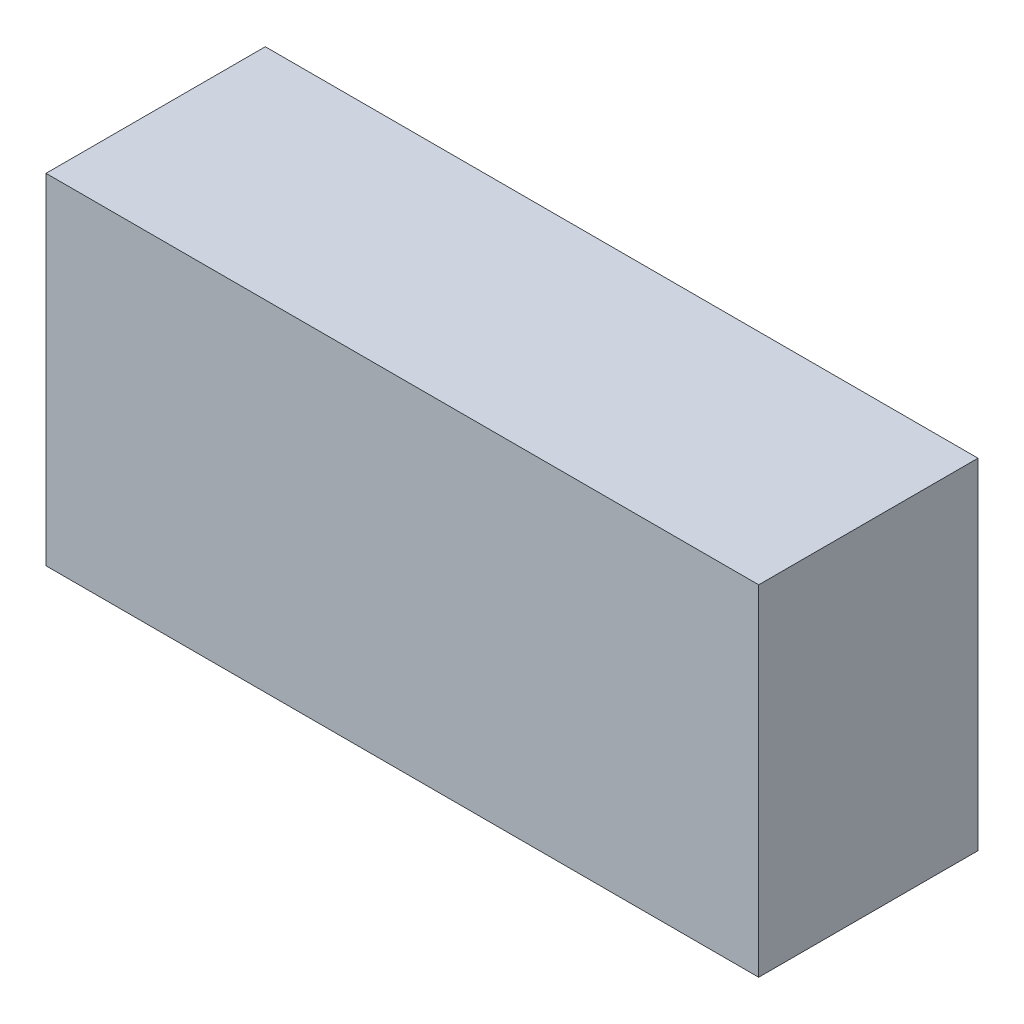
ISO-10303-21;
HEADER;
FILE_DESCRIPTION(('STEP AP214'),'2;1');
FILE_NAME('part.step','',(''),(''),'','','');
FILE_SCHEMA(('AUTOMOTIVE_DESIGN { 1 0 10303 214 1 1 1 1 }'));
ENDSEC;
DATA;
#1=APPLICATION_CONTEXT('core data for automotive mechanical design processes');
#2=APPLICATION_PROTOCOL_DEFINITION('international standard','automotive_design',2000,#1);
#3=PRODUCT_CONTEXT('',#1,'mechanical');
#4=PRODUCT('Part','Part','',(#3));
#5=PRODUCT_RELATED_PRODUCT_CATEGORY('part','',(#4));
#6=PRODUCT_DEFINITION_FORMATION('','',#4);
#7=PRODUCT_DEFINITION_CONTEXT('part definition',#1,'design');
#8=PRODUCT_DEFINITION('design','',#6,#7);
#9=PRODUCT_DEFINITION_SHAPE('','',#8);
#10=(LENGTH_UNIT() NAMED_UNIT(*) SI_UNIT(.MILLI.,.METRE.));
#11=(NAMED_UNIT(*) PLANE_ANGLE_UNIT() SI_UNIT($,.RADIAN.));
#12=(NAMED_UNIT(*) SI_UNIT($,.STERADIAN.) SOLID_ANGLE_UNIT());
#13=UNCERTAINTY_MEASURE_WITH_UNIT(LENGTH_MEASURE(1.E-05),#10,'distance_accuracy_value','');
#14=(GEOMETRIC_REPRESENTATION_CONTEXT(3) GLOBAL_UNCERTAINTY_ASSIGNED_CONTEXT((#13)) GLOBAL_UNIT_ASSIGNED_CONTEXT((#10,
#11,#12)) REPRESENTATION_CONTEXT('',''));
#15=CARTESIAN_POINT('',(0.,0.,0.));
#16=DIRECTION('',(0.,0.,1.));
#17=DIRECTION('',(1.,0.,0.));
#18=AXIS2_PLACEMENT_3D('',#15,#16,#17);
#19=CARTESIAN_POINT('',(9.75,9.3,-3.));
#20=DIRECTION('',(-1.,0.,0.));
#21=DIRECTION('',(0.,0.,1.));
#22=AXIS2_PLACEMENT_3D('',#19,#20,#21);
#23=PLANE('',#22);
#24=DIRECTION('',(0.,0.,-1.));
#25=VECTOR('',#24,1.);
#26=CARTESIAN_POINT('',(9.75,0.,-3.));
#27=LINE('',#26,#25);
#28=CARTESIAN_POINT('',(9.75,0.,3.));
#29=VERTEX_POINT('',#28);
#30=CARTESIAN_POINT('',(9.75,0.,-3.));
#31=VERTEX_POINT('',#30);
#32=EDGE_CURVE('E403',#29,#31,#27,.T.);
#33=ORIENTED_EDGE('',*,*,#32,.T.);
#34=DIRECTION('',(0.,-1.,0.));
#35=VECTOR('',#34,1.);
#36=CARTESIAN_POINT('',(9.75,9.3,-3.));
#37=LINE('',#36,#35);
#38=CARTESIAN_POINT('',(9.75,9.3,-3.));
#39=VERTEX_POINT('',#38);
#40=EDGE_CURVE('E11',#39,#31,#37,.T.);
#41=ORIENTED_EDGE('',*,*,#40,.F.);
#42=DIRECTION('',(0.,0.,-1.));
#43=VECTOR('',#42,1.);
#44=CARTESIAN_POINT('',(9.75,9.3,-3.));
#45=LINE('',#44,#43);
#46=CARTESIAN_POINT('',(9.75,9.3,3.));
#47=VERTEX_POINT('',#46);
#48=EDGE_CURVE('E414',#47,#39,#45,.T.);
#49=ORIENTED_EDGE('',*,*,#48,.F.);
#50=DIRECTION('',(0.,-1.,0.));
#51=VECTOR('',#50,1.);
#52=CARTESIAN_POINT('',(9.75,9.3,3.));
#53=LINE('',#52,#51);
#54=EDGE_CURVE('E428',#47,#29,#53,.T.);
#55=ORIENTED_EDGE('',*,*,#54,.T.);
#56=EDGE_LOOP('',(#33,#41,#49,#55));
#57=FACE_BOUND('',#56,.T.);
#58=ADVANCED_FACE('F39',(#57),#23,.F.);
#59=CARTESIAN_POINT('',(-9.75,9.3,-3.));
#60=DIRECTION('',(0.,0.,1.));
#61=DIRECTION('',(1.,0.,0.));
#62=AXIS2_PLACEMENT_3D('',#59,#60,#61);
#63=PLANE('',#62);
#64=DIRECTION('',(-1.,0.,0.));
#65=VECTOR('',#64,1.);
#66=CARTESIAN_POINT('',(-9.75,0.,-3.));
#67=LINE('',#66,#65);
#68=CARTESIAN_POINT('',(-9.75,0.,-3.));
#69=VERTEX_POINT('',#68);
#70=EDGE_CURVE('E432',#31,#69,#67,.T.);
#71=ORIENTED_EDGE('',*,*,#70,.T.);
#72=DIRECTION('',(0.,-1.,0.));
#73=VECTOR('',#72,1.);
#74=CARTESIAN_POINT('',(-9.75,9.3,-3.));
#75=LINE('',#74,#73);
#76=CARTESIAN_POINT('',(-9.75,9.3,-3.));
#77=VERTEX_POINT('',#76);
#78=EDGE_CURVE('E47',#77,#69,#75,.T.);
#79=ORIENTED_EDGE('',*,*,#78,.F.);
#80=DIRECTION('',(-1.,0.,0.));
#81=VECTOR('',#80,1.);
#82=CARTESIAN_POINT('',(-9.75,9.3,-3.));
#83=LINE('',#82,#81);
#84=EDGE_CURVE('E418',#39,#77,#83,.T.);
#85=ORIENTED_EDGE('',*,*,#84,.F.);
#86=ORIENTED_EDGE('',*,*,#40,.T.);
#87=EDGE_LOOP('',(#71,#79,#85,#86));
#88=FACE_BOUND('',#87,.T.);
#89=ADVANCED_FACE('F467',(#88),#63,.F.);
#90=CARTESIAN_POINT('',(-9.75,9.3,-3.));
#91=DIRECTION('',(1.,0.,0.));
#92=DIRECTION('',(0.,0.,-1.));
#93=AXIS2_PLACEMENT_3D('',#90,#91,#92);
#94=PLANE('',#93);
#95=DIRECTION('',(0.,0.,1.));
#96=VECTOR('',#95,1.);
#97=CARTESIAN_POINT('',(-9.75,0.,-3.));
#98=LINE('',#97,#96);
#99=CARTESIAN_POINT('',(-9.75,0.,3.));
#100=VERTEX_POINT('',#99);
#101=EDGE_CURVE('E435',#69,#100,#98,.T.);
#102=ORIENTED_EDGE('',*,*,#101,.T.);
#103=DIRECTION('',(0.,-1.,0.));
#104=VECTOR('',#103,1.);
#105=CARTESIAN_POINT('',(-9.75,9.3,3.));
#106=LINE('',#105,#104);
#107=CARTESIAN_POINT('',(-9.75,9.3,3.));
#108=VERTEX_POINT('',#107);
#109=EDGE_CURVE('E443',#108,#100,#106,.T.);
#110=ORIENTED_EDGE('',*,*,#109,.F.);
#111=DIRECTION('',(0.,0.,1.));
#112=VECTOR('',#111,1.);
#113=CARTESIAN_POINT('',(-9.75,9.3,-3.));
#114=LINE('',#113,#112);
#115=EDGE_CURVE('E422',#77,#108,#114,.T.);
#116=ORIENTED_EDGE('',*,*,#115,.F.);
#117=ORIENTED_EDGE('',*,*,#78,.T.);
#118=EDGE_LOOP('',(#102,#110,#116,#117));
#119=FACE_BOUND('',#118,.T.);
#120=ADVANCED_FACE('F452',(#119),#94,.F.);
#121=CARTESIAN_POINT('',(-9.75,9.3,3.));
#122=DIRECTION('',(0.,0.,-1.));
#123=DIRECTION('',(-1.,0.,0.));
#124=AXIS2_PLACEMENT_3D('',#121,#122,#123);
#125=PLANE('',#124);
#126=DIRECTION('',(1.,0.,0.));
#127=VECTOR('',#126,1.);
#128=CARTESIAN_POINT('',(-9.75,0.,3.));
#129=LINE('',#128,#127);
#130=EDGE_CURVE('E419',#100,#29,#129,.T.);
#131=ORIENTED_EDGE('',*,*,#130,.T.);
#132=ORIENTED_EDGE('',*,*,#54,.F.);
#133=DIRECTION('',(1.,0.,0.));
#134=VECTOR('',#133,1.);
#135=CARTESIAN_POINT('',(-9.75,9.3,3.));
#136=LINE('',#135,#134);
#137=EDGE_CURVE('E425',#108,#47,#136,.T.);
#138=ORIENTED_EDGE('',*,*,#137,.F.);
#139=ORIENTED_EDGE('',*,*,#109,.T.);
#140=EDGE_LOOP('',(#131,#132,#138,#139));
#141=FACE_BOUND('',#140,.T.);
#142=ADVANCED_FACE('F460',(#141),#125,.F.);
#143=CARTESIAN_POINT('',(0.,9.3,0.));
#144=DIRECTION('',(0.,1.,0.));
#145=DIRECTION('',(0.,0.,1.));
#146=AXIS2_PLACEMENT_3D('',#143,#144,#145);
#147=PLANE('',#146);
#148=ORIENTED_EDGE('',*,*,#48,.T.);
#149=ORIENTED_EDGE('',*,*,#84,.T.);
#150=ORIENTED_EDGE('',*,*,#115,.T.);
#151=ORIENTED_EDGE('',*,*,#137,.T.);
#152=EDGE_LOOP('',(#148,#149,#150,#151));
#153=FACE_BOUND('',#152,.T.);
#154=ADVANCED_FACE('F466',(#153),#147,.T.);
#155=CARTESIAN_POINT('',(0.,0.,0.));
#156=DIRECTION('',(0.,1.,0.));
#157=DIRECTION('',(0.,0.,1.));
#158=AXIS2_PLACEMENT_3D('',#155,#156,#157);
#159=PLANE('',#158);
#160=DIRECTION('',(0.,0.,-1.));
#161=VECTOR('',#160,1.);
#162=CARTESIAN_POINT('',(4.78,0.,-1.2));
#163=LINE('',#162,#161);
#164=CARTESIAN_POINT('',(4.78,0.,-1.2));
#165=VERTEX_POINT('',#164);
#166=CARTESIAN_POINT('',(4.78,0.,-1.5));
#167=VERTEX_POINT('',#166);
#168=EDGE_CURVE('E208',#165,#167,#163,.T.);
#169=ORIENTED_EDGE('',*,*,#168,.F.);
#170=DIRECTION('',(1.,0.,0.));
#171=VECTOR('',#170,1.);
#172=CARTESIAN_POINT('',(4.78,0.,-1.2));
#173=LINE('',#172,#171);
#174=CARTESIAN_POINT('',(5.38,0.,-1.2));
#175=VERTEX_POINT('',#174);
#176=EDGE_CURVE('E217',#165,#175,#173,.T.);
#177=ORIENTED_EDGE('',*,*,#176,.T.);
#178=DIRECTION('',(0.,0.,-1.));
#179=VECTOR('',#178,1.);
#180=CARTESIAN_POINT('',(5.38,0.,-1.2));
#181=LINE('',#180,#179);
#182=CARTESIAN_POINT('',(5.38,0.,-1.5));
#183=VERTEX_POINT('',#182);
#184=EDGE_CURVE('E225',#175,#183,#181,.T.);
#185=ORIENTED_EDGE('',*,*,#184,.T.);
#186=DIRECTION('',(1.,0.,0.));
#187=VECTOR('',#186,1.);
#188=CARTESIAN_POINT('',(4.78,0.,-1.5));
#189=LINE('',#188,#187);
#190=EDGE_CURVE('E54',#167,#183,#189,.T.);
#191=ORIENTED_EDGE('',*,*,#190,.F.);
#192=EDGE_LOOP('',(#169,#177,#185,#191));
#193=FACE_BOUND('',#192,.T.);
#194=DIRECTION('',(0.,0.,-1.));
#195=VECTOR('',#194,1.);
#196=CARTESIAN_POINT('',(2.24,0.,-1.2));
#197=LINE('',#196,#195);
#198=CARTESIAN_POINT('',(2.24,0.,-1.2));
#199=VERTEX_POINT('',#198);
#200=CARTESIAN_POINT('',(2.24,0.,-1.5));
#201=VERTEX_POINT('',#200);
#202=EDGE_CURVE('E261',#199,#201,#197,.T.);
#203=ORIENTED_EDGE('',*,*,#202,.F.);
#204=DIRECTION('',(1.,0.,0.));
#205=VECTOR('',#204,1.);
#206=CARTESIAN_POINT('',(2.24,0.,-1.2));
#207=LINE('',#206,#205);
#208=CARTESIAN_POINT('',(2.84,0.,-1.2));
#209=VERTEX_POINT('',#208);
#210=EDGE_CURVE('E271',#199,#209,#207,.T.);
#211=ORIENTED_EDGE('',*,*,#210,.T.);
#212=DIRECTION('',(0.,0.,-1.));
#213=VECTOR('',#212,1.);
#214=CARTESIAN_POINT('',(2.84,0.,-1.2));
#215=LINE('',#214,#213);
#216=CARTESIAN_POINT('',(2.84,0.,-1.5));
#217=VERTEX_POINT('',#216);
#218=EDGE_CURVE('E267',#209,#217,#215,.T.);
#219=ORIENTED_EDGE('',*,*,#218,.T.);
#220=DIRECTION('',(1.,0.,0.));
#221=VECTOR('',#220,1.);
#222=CARTESIAN_POINT('',(2.24,0.,-1.5));
#223=LINE('',#222,#221);
#224=EDGE_CURVE('E62',#201,#217,#223,.T.);
#225=ORIENTED_EDGE('',*,*,#224,.F.);
#226=EDGE_LOOP('',(#203,#211,#219,#225));
#227=FACE_BOUND('',#226,.T.);
#228=DIRECTION('',(0.,0.,-1.));
#229=VECTOR('',#228,1.);
#230=CARTESIAN_POINT('',(-0.299999999999996,0.,-1.2));
#231=LINE('',#230,#229);
#232=CARTESIAN_POINT('',(-0.299999999999996,0.,-1.2));
#233=VERTEX_POINT('',#232);
#234=CARTESIAN_POINT('',(-0.299999999999996,0.,-1.5));
#235=VERTEX_POINT('',#234);
#236=EDGE_CURVE('E302',#233,#235,#231,.T.);
#237=ORIENTED_EDGE('',*,*,#236,.F.);
#238=DIRECTION('',(1.,0.,0.));
#239=VECTOR('',#238,1.);
#240=CARTESIAN_POINT('',(-0.299999999999996,0.,-1.2));
#241=LINE('',#240,#239);
#242=CARTESIAN_POINT('',(0.300000000000004,0.,-1.2));
#243=VERTEX_POINT('',#242);
#244=EDGE_CURVE('E313',#233,#243,#241,.T.);
#245=ORIENTED_EDGE('',*,*,#244,.T.);
#246=DIRECTION('',(0.,0.,-1.));
#247=VECTOR('',#246,1.);
#248=CARTESIAN_POINT('',(0.300000000000004,0.,-1.2));
#249=LINE('',#248,#247);
#250=CARTESIAN_POINT('',(0.300000000000004,0.,-1.5));
#251=VERTEX_POINT('',#250);
#252=EDGE_CURVE('E309',#243,#251,#249,.T.);
#253=ORIENTED_EDGE('',*,*,#252,.T.);
#254=DIRECTION('',(1.,0.,0.));
#255=VECTOR('',#254,1.);
#256=CARTESIAN_POINT('',(-0.299999999999996,0.,-1.5));
#257=LINE('',#256,#255);
#258=EDGE_CURVE('E305',#235,#251,#257,.T.);
#259=ORIENTED_EDGE('',*,*,#258,.F.);
#260=EDGE_LOOP('',(#237,#245,#253,#259));
#261=FACE_BOUND('',#260,.T.);
#262=DIRECTION('',(0.,0.,-1.));
#263=VECTOR('',#262,1.);
#264=CARTESIAN_POINT('',(-5.38,0.,-1.2));
#265=LINE('',#264,#263);
#266=CARTESIAN_POINT('',(-5.38,0.,-1.2));
#267=VERTEX_POINT('',#266);
#268=CARTESIAN_POINT('',(-5.38,0.,-1.5));
#269=VERTEX_POINT('',#268);
#270=EDGE_CURVE('E344',#267,#269,#265,.T.);
#271=ORIENTED_EDGE('',*,*,#270,.F.);
#272=DIRECTION('',(1.,0.,0.));
#273=VECTOR('',#272,1.);
#274=CARTESIAN_POINT('',(-5.38,0.,-1.2));
#275=LINE('',#274,#273);
#276=CARTESIAN_POINT('',(-4.78,0.,-1.2));
#277=VERTEX_POINT('',#276);
#278=EDGE_CURVE('E355',#267,#277,#275,.T.);
#279=ORIENTED_EDGE('',*,*,#278,.T.);
#280=DIRECTION('',(0.,0.,-1.));
#281=VECTOR('',#280,1.);
#282=CARTESIAN_POINT('',(-4.78,0.,-1.2));
#283=LINE('',#282,#281);
#284=CARTESIAN_POINT('',(-4.78,0.,-1.5));
#285=VERTEX_POINT('',#284);
#286=EDGE_CURVE('E351',#277,#285,#283,.T.);
#287=ORIENTED_EDGE('',*,*,#286,.T.);
#288=DIRECTION('',(1.,0.,0.));
#289=VECTOR('',#288,1.);
#290=CARTESIAN_POINT('',(-5.38,0.,-1.5));
#291=LINE('',#290,#289);
#292=EDGE_CURVE('E347',#269,#285,#291,.T.);
#293=ORIENTED_EDGE('',*,*,#292,.F.);
#294=EDGE_LOOP('',(#271,#279,#287,#293));
#295=FACE_BOUND('',#294,.T.);
#296=DIRECTION('',(0.,0.,-1.));
#297=VECTOR('',#296,1.);
#298=CARTESIAN_POINT('',(-7.92,0.,-1.2));
#299=LINE('',#298,#297);
#300=CARTESIAN_POINT('',(-7.92,0.,-1.2));
#301=VERTEX_POINT('',#300);
#302=CARTESIAN_POINT('',(-7.92,0.,-1.5));
#303=VERTEX_POINT('',#302);
#304=EDGE_CURVE('E377',#301,#303,#299,.T.);
#305=ORIENTED_EDGE('',*,*,#304,.F.);
#306=DIRECTION('',(1.,0.,0.));
#307=VECTOR('',#306,1.);
#308=CARTESIAN_POINT('',(-7.92,0.,-1.2));
#309=LINE('',#308,#307);
#310=CARTESIAN_POINT('',(-7.32,0.,-1.2));
#311=VERTEX_POINT('',#310);
#312=EDGE_CURVE('E359',#301,#311,#309,.T.);
#313=ORIENTED_EDGE('',*,*,#312,.T.);
#314=DIRECTION('',(0.,0.,-1.));
#315=VECTOR('',#314,1.);
#316=CARTESIAN_POINT('',(-7.32,0.,-1.2));
#317=LINE('',#316,#315);
#318=CARTESIAN_POINT('',(-7.31999999999999,0.,-1.5));
#319=VERTEX_POINT('',#318);
#320=EDGE_CURVE('E391',#311,#319,#317,.T.);
#321=ORIENTED_EDGE('',*,*,#320,.T.);
#322=DIRECTION('',(1.,0.,0.));
#323=VECTOR('',#322,1.);
#324=CARTESIAN_POINT('',(-7.92,0.,-1.5));
#325=LINE('',#324,#323);
#326=EDGE_CURVE('E395',#303,#319,#325,.T.);
#327=ORIENTED_EDGE('',*,*,#326,.F.);
#328=EDGE_LOOP('',(#305,#313,#321,#327));
#329=FACE_BOUND('',#328,.T.);
#330=ORIENTED_EDGE('',*,*,#32,.F.);
#331=ORIENTED_EDGE('',*,*,#130,.F.);
#332=ORIENTED_EDGE('',*,*,#101,.F.);
#333=ORIENTED_EDGE('',*,*,#70,.F.);
#334=EDGE_LOOP('',(#330,#331,#332,#333));
#335=FACE_BOUND('',#334,.T.);
#336=ADVANCED_FACE('F227',(#193,#227,#261,#295,#329,#335),#159,.F.);
#337=CARTESIAN_POINT('',(-7.92,-3.,-1.2));
#338=DIRECTION('',(0.,0.,1.));
#339=DIRECTION('',(1.,0.,0.));
#340=AXIS2_PLACEMENT_3D('',#337,#338,#339);
#341=PLANE('',#340);
#342=ORIENTED_EDGE('',*,*,#312,.F.);
#343=DIRECTION('',(0.,1.,0.));
#344=VECTOR('',#343,1.);
#345=CARTESIAN_POINT('',(-7.92,-3.,-1.2));
#346=LINE('',#345,#344);
#347=CARTESIAN_POINT('',(-7.92,-3.,-1.2));
#348=VERTEX_POINT('',#347);
#349=EDGE_CURVE('E400',#348,#301,#346,.T.);
#350=ORIENTED_EDGE('',*,*,#349,.F.);
#351=DIRECTION('',(1.,0.,0.));
#352=VECTOR('',#351,1.);
#353=CARTESIAN_POINT('',(-7.92,-3.,-1.2));
#354=LINE('',#353,#352);
#355=CARTESIAN_POINT('',(-7.32,-3.,-1.2));
#356=VERTEX_POINT('',#355);
#357=EDGE_CURVE('E372',#348,#356,#354,.T.);
#358=ORIENTED_EDGE('',*,*,#357,.T.);
#359=DIRECTION('',(0.,1.,0.));
#360=VECTOR('',#359,1.);
#361=CARTESIAN_POINT('',(-7.32,-3.,-1.2));
#362=LINE('',#361,#360);
#363=EDGE_CURVE('E387',#356,#311,#362,.T.);
#364=ORIENTED_EDGE('',*,*,#363,.T.);
#365=EDGE_LOOP('',(#342,#350,#358,#364));
#366=FACE_BOUND('',#365,.T.);
#367=ADVANCED_FACE('F479',(#366),#341,.T.);
#368=CARTESIAN_POINT('',(-7.92,-3.,-1.2));
#369=DIRECTION('',(1.,0.,0.));
#370=DIRECTION('',(0.,0.,-1.));
#371=AXIS2_PLACEMENT_3D('',#368,#369,#370);
#372=PLANE('',#371);
#373=ORIENTED_EDGE('',*,*,#304,.T.);
#374=DIRECTION('',(0.,1.,0.));
#375=VECTOR('',#374,1.);
#376=CARTESIAN_POINT('',(-7.92,-3.,-1.5));
#377=LINE('',#376,#375);
#378=CARTESIAN_POINT('',(-7.92,-3.,-1.5));
#379=VERTEX_POINT('',#378);
#380=EDGE_CURVE('E404',#379,#303,#377,.T.);
#381=ORIENTED_EDGE('',*,*,#380,.F.);
#382=DIRECTION('',(0.,0.,-1.));
#383=VECTOR('',#382,1.);
#384=CARTESIAN_POINT('',(-7.92,-3.,-1.2));
#385=LINE('',#384,#383);
#386=EDGE_CURVE('E384',#348,#379,#385,.T.);
#387=ORIENTED_EDGE('',*,*,#386,.F.);
#388=ORIENTED_EDGE('',*,*,#349,.T.);
#389=EDGE_LOOP('',(#373,#381,#387,#388));
#390=FACE_BOUND('',#389,.T.);
#391=ADVANCED_FACE('F484',(#390),#372,.F.);
#392=CARTESIAN_POINT('',(-7.92,-3.,-1.5));
#393=DIRECTION('',(0.,0.,1.));
#394=DIRECTION('',(1.,0.,0.));
#395=AXIS2_PLACEMENT_3D('',#392,#393,#394);
#396=PLANE('',#395);
#397=ORIENTED_EDGE('',*,*,#326,.T.);
#398=DIRECTION('',(0.,1.,0.));
#399=VECTOR('',#398,1.);
#400=CARTESIAN_POINT('',(-7.31999999999999,-3.,-1.5));
#401=LINE('',#400,#399);
#402=CARTESIAN_POINT('',(-7.31999999999999,-3.,-1.5));
#403=VERTEX_POINT('',#402);
#404=EDGE_CURVE('E408',#403,#319,#401,.T.);
#405=ORIENTED_EDGE('',*,*,#404,.F.);
#406=DIRECTION('',(1.,0.,0.));
#407=VECTOR('',#406,1.);
#408=CARTESIAN_POINT('',(-7.92,-3.,-1.5));
#409=LINE('',#408,#407);
#410=EDGE_CURVE('E381',#379,#403,#409,.T.);
#411=ORIENTED_EDGE('',*,*,#410,.F.);
#412=ORIENTED_EDGE('',*,*,#380,.T.);
#413=EDGE_LOOP('',(#397,#405,#411,#412));
#414=FACE_BOUND('',#413,.T.);
#415=ADVANCED_FACE('F490',(#414),#396,.F.);
#416=CARTESIAN_POINT('',(-7.32,-3.,-1.2));
#417=DIRECTION('',(1.,0.,0.));
#418=DIRECTION('',(0.,0.,-1.));
#419=AXIS2_PLACEMENT_3D('',#416,#417,#418);
#420=PLANE('',#419);
#421=ORIENTED_EDGE('',*,*,#320,.F.);
#422=ORIENTED_EDGE('',*,*,#363,.F.);
#423=DIRECTION('',(0.,0.,-1.));
#424=VECTOR('',#423,1.);
#425=CARTESIAN_POINT('',(-7.32,-3.,-1.2));
#426=LINE('',#425,#424);
#427=EDGE_CURVE('E376',#356,#403,#426,.T.);
#428=ORIENTED_EDGE('',*,*,#427,.T.);
#429=ORIENTED_EDGE('',*,*,#404,.T.);
#430=EDGE_LOOP('',(#421,#422,#428,#429));
#431=FACE_BOUND('',#430,.T.);
#432=ADVANCED_FACE('F486',(#431),#420,.T.);
#433=CARTESIAN_POINT('',(0.,-3.,0.));
#434=DIRECTION('',(0.,1.,0.));
#435=DIRECTION('',(0.,0.,1.));
#436=AXIS2_PLACEMENT_3D('',#433,#434,#435);
#437=PLANE('',#436);
#438=ORIENTED_EDGE('',*,*,#357,.F.);
#439=ORIENTED_EDGE('',*,*,#386,.T.);
#440=ORIENTED_EDGE('',*,*,#410,.T.);
#441=ORIENTED_EDGE('',*,*,#427,.F.);
#442=EDGE_LOOP('',(#438,#439,#440,#441));
#443=FACE_BOUND('',#442,.T.);
#444=ADVANCED_FACE('F489',(#443),#437,.F.);
#445=CARTESIAN_POINT('',(-5.38,-3.,-1.2));
#446=DIRECTION('',(0.,0.,1.));
#447=DIRECTION('',(1.,0.,0.));
#448=AXIS2_PLACEMENT_3D('',#445,#446,#447);
#449=PLANE('',#448);
#450=ORIENTED_EDGE('',*,*,#278,.F.);
#451=DIRECTION('',(0.,1.,0.));
#452=VECTOR('',#451,1.);
#453=CARTESIAN_POINT('',(-5.38,-3.,-1.2));
#454=LINE('',#453,#452);
#455=CARTESIAN_POINT('',(-5.38,-3.,-1.2));
#456=VERTEX_POINT('',#455);
#457=EDGE_CURVE('E317',#456,#267,#454,.T.);
#458=ORIENTED_EDGE('',*,*,#457,.F.);
#459=DIRECTION('',(1.,0.,0.));
#460=VECTOR('',#459,1.);
#461=CARTESIAN_POINT('',(-5.38,-3.,-1.2));
#462=LINE('',#461,#460);
#463=CARTESIAN_POINT('',(-4.78,-3.,-1.2));
#464=VERTEX_POINT('',#463);
#465=EDGE_CURVE('E348',#456,#464,#462,.T.);
#466=ORIENTED_EDGE('',*,*,#465,.T.);
#467=DIRECTION('',(0.,1.,0.));
#468=VECTOR('',#467,1.);
#469=CARTESIAN_POINT('',(-4.78,-3.,-1.2));
#470=LINE('',#469,#468);
#471=EDGE_CURVE('E330',#464,#277,#470,.T.);
#472=ORIENTED_EDGE('',*,*,#471,.T.);
#473=EDGE_LOOP('',(#450,#458,#466,#472));
#474=FACE_BOUND('',#473,.T.);
#475=ADVANCED_FACE('F500',(#474),#449,.T.);
#476=CARTESIAN_POINT('',(-5.38,-3.,-1.2));
#477=DIRECTION('',(1.,0.,0.));
#478=DIRECTION('',(0.,0.,-1.));
#479=AXIS2_PLACEMENT_3D('',#476,#477,#478);
#480=PLANE('',#479);
#481=ORIENTED_EDGE('',*,*,#270,.T.);
#482=DIRECTION('',(0.,1.,0.));
#483=VECTOR('',#482,1.);
#484=CARTESIAN_POINT('',(-5.38,-3.,-1.5));
#485=LINE('',#484,#483);
#486=CARTESIAN_POINT('',(-5.38,-3.,-1.5));
#487=VERTEX_POINT('',#486);
#488=EDGE_CURVE('E338',#487,#269,#485,.T.);
#489=ORIENTED_EDGE('',*,*,#488,.F.);
#490=DIRECTION('',(0.,0.,-1.));
#491=VECTOR('',#490,1.);
#492=CARTESIAN_POINT('',(-5.38,-3.,-1.2));
#493=LINE('',#492,#491);
#494=EDGE_CURVE('E333',#456,#487,#493,.T.);
#495=ORIENTED_EDGE('',*,*,#494,.F.);
#496=ORIENTED_EDGE('',*,*,#457,.T.);
#497=EDGE_LOOP('',(#481,#489,#495,#496));
#498=FACE_BOUND('',#497,.T.);
#499=ADVANCED_FACE('F508',(#498),#480,.F.);
#500=CARTESIAN_POINT('',(-5.38,-3.,-1.5));
#501=DIRECTION('',(0.,0.,1.));
#502=DIRECTION('',(1.,0.,0.));
#503=AXIS2_PLACEMENT_3D('',#500,#501,#502);
#504=PLANE('',#503);
#505=ORIENTED_EDGE('',*,*,#292,.T.);
#506=DIRECTION('',(0.,1.,0.));
#507=VECTOR('',#506,1.);
#508=CARTESIAN_POINT('',(-4.78,-3.,-1.5));
#509=LINE('',#508,#507);
#510=CARTESIAN_POINT('',(-4.78,-3.,-1.5));
#511=VERTEX_POINT('',#510);
#512=EDGE_CURVE('E334',#511,#285,#509,.T.);
#513=ORIENTED_EDGE('',*,*,#512,.F.);
#514=DIRECTION('',(1.,0.,0.));
#515=VECTOR('',#514,1.);
#516=CARTESIAN_POINT('',(-5.38,-3.,-1.5));
#517=LINE('',#516,#515);
#518=EDGE_CURVE('E362',#487,#511,#517,.T.);
#519=ORIENTED_EDGE('',*,*,#518,.F.);
#520=ORIENTED_EDGE('',*,*,#488,.T.);
#521=EDGE_LOOP('',(#505,#513,#519,#520));
#522=FACE_BOUND('',#521,.T.);
#523=ADVANCED_FACE('F511',(#522),#504,.F.);
#524=CARTESIAN_POINT('',(-4.78,-3.,-1.2));
#525=DIRECTION('',(1.,0.,0.));
#526=DIRECTION('',(0.,0.,-1.));
#527=AXIS2_PLACEMENT_3D('',#524,#525,#526);
#528=PLANE('',#527);
#529=ORIENTED_EDGE('',*,*,#286,.F.);
#530=ORIENTED_EDGE('',*,*,#471,.F.);
#531=DIRECTION('',(0.,0.,-1.));
#532=VECTOR('',#531,1.);
#533=CARTESIAN_POINT('',(-4.78,-3.,-1.2));
#534=LINE('',#533,#532);
#535=EDGE_CURVE('E365',#464,#511,#534,.T.);
#536=ORIENTED_EDGE('',*,*,#535,.T.);
#537=ORIENTED_EDGE('',*,*,#512,.T.);
#538=EDGE_LOOP('',(#529,#530,#536,#537));
#539=FACE_BOUND('',#538,.T.);
#540=ADVANCED_FACE('F506',(#539),#528,.T.);
#541=CARTESIAN_POINT('',(0.,-3.,0.));
#542=DIRECTION('',(0.,1.,0.));
#543=DIRECTION('',(0.,0.,1.));
#544=AXIS2_PLACEMENT_3D('',#541,#542,#543);
#545=PLANE('',#544);
#546=ORIENTED_EDGE('',*,*,#465,.F.);
#547=ORIENTED_EDGE('',*,*,#494,.T.);
#548=ORIENTED_EDGE('',*,*,#518,.T.);
#549=ORIENTED_EDGE('',*,*,#535,.F.);
#550=EDGE_LOOP('',(#546,#547,#548,#549));
#551=FACE_BOUND('',#550,.T.);
#552=ADVANCED_FACE('F502',(#551),#545,.F.);
#553=CARTESIAN_POINT('',(-0.299999999999996,-3.,-1.2));
#554=DIRECTION('',(0.,0.,1.));
#555=DIRECTION('',(1.,0.,0.));
#556=AXIS2_PLACEMENT_3D('',#553,#554,#555);
#557=PLANE('',#556);
#558=ORIENTED_EDGE('',*,*,#244,.F.);
#559=DIRECTION('',(0.,1.,0.));
#560=VECTOR('',#559,1.);
#561=CARTESIAN_POINT('',(-0.299999999999996,-3.,-1.2));
#562=LINE('',#561,#560);
#563=CARTESIAN_POINT('',(-0.299999999999996,-3.,-1.2));
#564=VERTEX_POINT('',#563);
#565=EDGE_CURVE('E275',#564,#233,#562,.T.);
#566=ORIENTED_EDGE('',*,*,#565,.F.);
#567=DIRECTION('',(1.,0.,0.));
#568=VECTOR('',#567,1.);
#569=CARTESIAN_POINT('',(-0.299999999999996,-3.,-1.2));
#570=LINE('',#569,#568);
#571=CARTESIAN_POINT('',(0.300000000000004,-3.,-1.2));
#572=VERTEX_POINT('',#571);
#573=EDGE_CURVE('E306',#564,#572,#570,.T.);
#574=ORIENTED_EDGE('',*,*,#573,.T.);
#575=DIRECTION('',(0.,1.,0.));
#576=VECTOR('',#575,1.);
#577=CARTESIAN_POINT('',(0.300000000000004,-3.,-1.2));
#578=LINE('',#577,#576);
#579=EDGE_CURVE('E288',#572,#243,#578,.T.);
#580=ORIENTED_EDGE('',*,*,#579,.T.);
#581=EDGE_LOOP('',(#558,#566,#574,#580));
#582=FACE_BOUND('',#581,.T.);
#583=ADVANCED_FACE('F505',(#582),#557,.T.);
#584=CARTESIAN_POINT('',(-0.299999999999996,-3.,-1.2));
#585=DIRECTION('',(1.,0.,0.));
#586=DIRECTION('',(0.,0.,-1.));
#587=AXIS2_PLACEMENT_3D('',#584,#585,#586);
#588=PLANE('',#587);
#589=ORIENTED_EDGE('',*,*,#236,.T.);
#590=DIRECTION('',(0.,1.,0.));
#591=VECTOR('',#590,1.);
#592=CARTESIAN_POINT('',(-0.299999999999996,-3.,-1.5));
#593=LINE('',#592,#591);
#594=CARTESIAN_POINT('',(-0.299999999999996,-3.,-1.5));
#595=VERTEX_POINT('',#594);
#596=EDGE_CURVE('E296',#595,#235,#593,.T.);
#597=ORIENTED_EDGE('',*,*,#596,.F.);
#598=DIRECTION('',(0.,0.,-1.));
#599=VECTOR('',#598,1.);
#600=CARTESIAN_POINT('',(-0.299999999999996,-3.,-1.2));
#601=LINE('',#600,#599);
#602=EDGE_CURVE('E291',#564,#595,#601,.T.);
#603=ORIENTED_EDGE('',*,*,#602,.F.);
#604=ORIENTED_EDGE('',*,*,#565,.T.);
#605=EDGE_LOOP('',(#589,#597,#603,#604));
#606=FACE_BOUND('',#605,.T.);
#607=ADVANCED_FACE('F528',(#606),#588,.F.);
#608=CARTESIAN_POINT('',(-0.299999999999996,-3.,-1.5));
#609=DIRECTION('',(0.,0.,1.));
#610=DIRECTION('',(1.,0.,0.));
#611=AXIS2_PLACEMENT_3D('',#608,#609,#610);
#612=PLANE('',#611);
#613=ORIENTED_EDGE('',*,*,#258,.T.);
#614=DIRECTION('',(0.,1.,0.));
#615=VECTOR('',#614,1.);
#616=CARTESIAN_POINT('',(0.300000000000004,-3.,-1.5));
#617=LINE('',#616,#615);
#618=CARTESIAN_POINT('',(0.300000000000004,-3.,-1.5));
#619=VERTEX_POINT('',#618);
#620=EDGE_CURVE('E292',#619,#251,#617,.T.);
#621=ORIENTED_EDGE('',*,*,#620,.F.);
#622=DIRECTION('',(1.,0.,0.));
#623=VECTOR('',#622,1.);
#624=CARTESIAN_POINT('',(-0.299999999999996,-3.,-1.5));
#625=LINE('',#624,#623);
#626=EDGE_CURVE('E320',#595,#619,#625,.T.);
#627=ORIENTED_EDGE('',*,*,#626,.F.);
#628=ORIENTED_EDGE('',*,*,#596,.T.);
#629=EDGE_LOOP('',(#613,#621,#627,#628));
#630=FACE_BOUND('',#629,.T.);
#631=ADVANCED_FACE('F531',(#630),#612,.F.);
#632=CARTESIAN_POINT('',(0.300000000000004,-3.,-1.2));
#633=DIRECTION('',(1.,0.,0.));
#634=DIRECTION('',(0.,0.,-1.));
#635=AXIS2_PLACEMENT_3D('',#632,#633,#634);
#636=PLANE('',#635);
#637=ORIENTED_EDGE('',*,*,#252,.F.);
#638=ORIENTED_EDGE('',*,*,#579,.F.);
#639=DIRECTION('',(0.,0.,-1.));
#640=VECTOR('',#639,1.);
#641=CARTESIAN_POINT('',(0.300000000000004,-3.,-1.2));
#642=LINE('',#641,#640);
#643=EDGE_CURVE('E323',#572,#619,#642,.T.);
#644=ORIENTED_EDGE('',*,*,#643,.T.);
#645=ORIENTED_EDGE('',*,*,#620,.T.);
#646=EDGE_LOOP('',(#637,#638,#644,#645));
#647=FACE_BOUND('',#646,.T.);
#648=ADVANCED_FACE('F526',(#647),#636,.T.);
#649=CARTESIAN_POINT('',(0.,-3.,0.));
#650=DIRECTION('',(0.,1.,0.));
#651=DIRECTION('',(0.,0.,1.));
#652=AXIS2_PLACEMENT_3D('',#649,#650,#651);
#653=PLANE('',#652);
#654=ORIENTED_EDGE('',*,*,#573,.F.);
#655=ORIENTED_EDGE('',*,*,#602,.T.);
#656=ORIENTED_EDGE('',*,*,#626,.T.);
#657=ORIENTED_EDGE('',*,*,#643,.F.);
#658=EDGE_LOOP('',(#654,#655,#656,#657));
#659=FACE_BOUND('',#658,.T.);
#660=ADVANCED_FACE('F522',(#659),#653,.F.);
#661=CARTESIAN_POINT('',(2.24,-3.,-1.2));
#662=DIRECTION('',(0.,0.,1.));
#663=DIRECTION('',(1.,0.,0.));
#664=AXIS2_PLACEMENT_3D('',#661,#662,#663);
#665=PLANE('',#664);
#666=ORIENTED_EDGE('',*,*,#210,.F.);
#667=DIRECTION('',(0.,1.,0.));
#668=VECTOR('',#667,1.);
#669=CARTESIAN_POINT('',(2.24,-3.,-1.2));
#670=LINE('',#669,#668);
#671=CARTESIAN_POINT('',(2.24,-3.,-1.2));
#672=VERTEX_POINT('',#671);
#673=EDGE_CURVE('E224',#672,#199,#670,.T.);
#674=ORIENTED_EDGE('',*,*,#673,.F.);
#675=DIRECTION('',(1.,0.,0.));
#676=VECTOR('',#675,1.);
#677=CARTESIAN_POINT('',(2.24,-3.,-1.2));
#678=LINE('',#677,#676);
#679=CARTESIAN_POINT('',(2.84,-3.,-1.2));
#680=VERTEX_POINT('',#679);
#681=EDGE_CURVE('E264',#672,#680,#678,.T.);
#682=ORIENTED_EDGE('',*,*,#681,.T.);
#683=DIRECTION('',(0.,1.,0.));
#684=VECTOR('',#683,1.);
#685=CARTESIAN_POINT('',(2.84,-3.,-1.2));
#686=LINE('',#685,#684);
#687=EDGE_CURVE('E249',#680,#209,#686,.T.);
#688=ORIENTED_EDGE('',*,*,#687,.T.);
#689=EDGE_LOOP('',(#666,#674,#682,#688));
#690=FACE_BOUND('',#689,.T.);
#691=ADVANCED_FACE('F525',(#690),#665,.T.);
#692=CARTESIAN_POINT('',(2.24,-3.,-1.2));
#693=DIRECTION('',(1.,0.,0.));
#694=DIRECTION('',(0.,0.,-1.));
#695=AXIS2_PLACEMENT_3D('',#692,#693,#694);
#696=PLANE('',#695);
#697=ORIENTED_EDGE('',*,*,#202,.T.);
#698=DIRECTION('',(0.,1.,0.));
#699=VECTOR('',#698,1.);
#700=CARTESIAN_POINT('',(2.24,-3.,-1.5));
#701=LINE('',#700,#699);
#702=CARTESIAN_POINT('',(2.24,-3.,-1.5));
#703=VERTEX_POINT('',#702);
#704=EDGE_CURVE('E256',#703,#201,#701,.T.);
#705=ORIENTED_EDGE('',*,*,#704,.F.);
#706=DIRECTION('',(0.,0.,-1.));
#707=VECTOR('',#706,1.);
#708=CARTESIAN_POINT('',(2.24,-3.,-1.2));
#709=LINE('',#708,#707);
#710=EDGE_CURVE('E252',#672,#703,#709,.T.);
#711=ORIENTED_EDGE('',*,*,#710,.F.);
#712=ORIENTED_EDGE('',*,*,#673,.T.);
#713=EDGE_LOOP('',(#697,#705,#711,#712));
#714=FACE_BOUND('',#713,.T.);
#715=ADVANCED_FACE('F547',(#714),#696,.F.);
#716=CARTESIAN_POINT('',(2.24,-3.,-1.5));
#717=DIRECTION('',(0.,0.,1.));
#718=DIRECTION('',(1.,0.,0.));
#719=AXIS2_PLACEMENT_3D('',#716,#717,#718);
#720=PLANE('',#719);
#721=ORIENTED_EDGE('',*,*,#224,.T.);
#722=DIRECTION('',(0.,1.,0.));
#723=VECTOR('',#722,1.);
#724=CARTESIAN_POINT('',(2.84,-3.,-1.5));
#725=LINE('',#724,#723);
#726=CARTESIAN_POINT('',(2.84,-3.,-1.5));
#727=VERTEX_POINT('',#726);
#728=EDGE_CURVE('E253',#727,#217,#725,.T.);
#729=ORIENTED_EDGE('',*,*,#728,.F.);
#730=DIRECTION('',(1.,0.,0.));
#731=VECTOR('',#730,1.);
#732=CARTESIAN_POINT('',(2.24,-3.,-1.5));
#733=LINE('',#732,#731);
#734=EDGE_CURVE('E278',#703,#727,#733,.T.);
#735=ORIENTED_EDGE('',*,*,#734,.F.);
#736=ORIENTED_EDGE('',*,*,#704,.T.);
#737=EDGE_LOOP('',(#721,#729,#735,#736));
#738=FACE_BOUND('',#737,.T.);
#739=ADVANCED_FACE('F550',(#738),#720,.F.);
#740=CARTESIAN_POINT('',(2.84,-3.,-1.2));
#741=DIRECTION('',(1.,0.,0.));
#742=DIRECTION('',(0.,0.,-1.));
#743=AXIS2_PLACEMENT_3D('',#740,#741,#742);
#744=PLANE('',#743);
#745=ORIENTED_EDGE('',*,*,#218,.F.);
#746=ORIENTED_EDGE('',*,*,#687,.F.);
#747=DIRECTION('',(0.,0.,-1.));
#748=VECTOR('',#747,1.);
#749=CARTESIAN_POINT('',(2.84,-3.,-1.2));
#750=LINE('',#749,#748);
#751=EDGE_CURVE('E281',#680,#727,#750,.T.);
#752=ORIENTED_EDGE('',*,*,#751,.T.);
#753=ORIENTED_EDGE('',*,*,#728,.T.);
#754=EDGE_LOOP('',(#745,#746,#752,#753));
#755=FACE_BOUND('',#754,.T.);
#756=ADVANCED_FACE('F545',(#755),#744,.T.);
#757=CARTESIAN_POINT('',(0.,-3.,0.));
#758=DIRECTION('',(0.,1.,0.));
#759=DIRECTION('',(0.,0.,1.));
#760=AXIS2_PLACEMENT_3D('',#757,#758,#759);
#761=PLANE('',#760);
#762=ORIENTED_EDGE('',*,*,#681,.F.);
#763=ORIENTED_EDGE('',*,*,#710,.T.);
#764=ORIENTED_EDGE('',*,*,#734,.T.);
#765=ORIENTED_EDGE('',*,*,#751,.F.);
#766=EDGE_LOOP('',(#762,#763,#764,#765));
#767=FACE_BOUND('',#766,.T.);
#768=ADVANCED_FACE('F542',(#767),#761,.F.);
#769=CARTESIAN_POINT('',(4.78,-3.,-1.2));
#770=DIRECTION('',(0.,0.,1.));
#771=DIRECTION('',(1.,0.,0.));
#772=AXIS2_PLACEMENT_3D('',#769,#770,#771);
#773=PLANE('',#772);
#774=ORIENTED_EDGE('',*,*,#176,.F.);
#775=DIRECTION('',(0.,1.,0.));
#776=VECTOR('',#775,1.);
#777=CARTESIAN_POINT('',(4.78,-3.,-1.2));
#778=LINE('',#777,#776);
#779=CARTESIAN_POINT('',(4.78,-3.,-1.2));
#780=VERTEX_POINT('',#779);
#781=EDGE_CURVE('E203',#780,#165,#778,.T.);
#782=ORIENTED_EDGE('',*,*,#781,.F.);
#783=DIRECTION('',(1.,0.,0.));
#784=VECTOR('',#783,1.);
#785=CARTESIAN_POINT('',(4.78,-3.,-1.2));
#786=LINE('',#785,#784);
#787=CARTESIAN_POINT('',(5.38,-3.,-1.2));
#788=VERTEX_POINT('',#787);
#789=EDGE_CURVE('E230',#780,#788,#786,.T.);
#790=ORIENTED_EDGE('',*,*,#789,.T.);
#791=DIRECTION('',(0.,1.,0.));
#792=VECTOR('',#791,1.);
#793=CARTESIAN_POINT('',(5.38,-3.,-1.2));
#794=LINE('',#793,#792);
#795=EDGE_CURVE('E219',#788,#175,#794,.T.);
#796=ORIENTED_EDGE('',*,*,#795,.T.);
#797=EDGE_LOOP('',(#774,#782,#790,#796));
#798=FACE_BOUND('',#797,.T.);
#799=ADVANCED_FACE('F218',(#798),#773,.T.);
#800=CARTESIAN_POINT('',(4.78,-3.,-1.2));
#801=DIRECTION('',(1.,0.,0.));
#802=DIRECTION('',(0.,0.,-1.));
#803=AXIS2_PLACEMENT_3D('',#800,#801,#802);
#804=PLANE('',#803);
#805=ORIENTED_EDGE('',*,*,#168,.T.);
#806=DIRECTION('',(0.,1.,0.));
#807=VECTOR('',#806,1.);
#808=CARTESIAN_POINT('',(4.78,-3.,-1.5));
#809=LINE('',#808,#807);
#810=CARTESIAN_POINT('',(4.78,-3.,-1.5));
#811=VERTEX_POINT('',#810);
#812=EDGE_CURVE('E214',#811,#167,#809,.T.);
#813=ORIENTED_EDGE('',*,*,#812,.F.);
#814=DIRECTION('',(0.,0.,-1.));
#815=VECTOR('',#814,1.);
#816=CARTESIAN_POINT('',(4.78,-3.,-1.2));
#817=LINE('',#816,#815);
#818=EDGE_CURVE('E209',#780,#811,#817,.T.);
#819=ORIENTED_EDGE('',*,*,#818,.F.);
#820=ORIENTED_EDGE('',*,*,#781,.T.);
#821=EDGE_LOOP('',(#805,#813,#819,#820));
#822=FACE_BOUND('',#821,.T.);
#823=ADVANCED_FACE('F205',(#822),#804,.F.);
#824=CARTESIAN_POINT('',(4.78,-3.,-1.5));
#825=DIRECTION('',(0.,0.,1.));
#826=DIRECTION('',(1.,0.,0.));
#827=AXIS2_PLACEMENT_3D('',#824,#825,#826);
#828=PLANE('',#827);
#829=ORIENTED_EDGE('',*,*,#190,.T.);
#830=DIRECTION('',(0.,1.,0.));
#831=VECTOR('',#830,1.);
#832=CARTESIAN_POINT('',(5.38,-3.,-1.5));
#833=LINE('',#832,#831);
#834=CARTESIAN_POINT('',(5.38,-3.,-1.5));
#835=VERTEX_POINT('',#834);
#836=EDGE_CURVE('E759',#835,#183,#833,.T.);
#837=ORIENTED_EDGE('',*,*,#836,.F.);
#838=DIRECTION('',(1.,0.,0.));
#839=VECTOR('',#838,1.);
#840=CARTESIAN_POINT('',(4.78,-3.,-1.5));
#841=LINE('',#840,#839);
#842=EDGE_CURVE('E243',#811,#835,#841,.T.);
#843=ORIENTED_EDGE('',*,*,#842,.F.);
#844=ORIENTED_EDGE('',*,*,#812,.T.);
#845=EDGE_LOOP('',(#829,#837,#843,#844));
#846=FACE_BOUND('',#845,.T.);
#847=ADVANCED_FACE('F567',(#846),#828,.F.);
#848=CARTESIAN_POINT('',(5.38,-3.,-1.2));
#849=DIRECTION('',(1.,0.,0.));
#850=DIRECTION('',(0.,0.,-1.));
#851=AXIS2_PLACEMENT_3D('',#848,#849,#850);
#852=PLANE('',#851);
#853=ORIENTED_EDGE('',*,*,#184,.F.);
#854=ORIENTED_EDGE('',*,*,#795,.F.);
#855=DIRECTION('',(0.,0.,-1.));
#856=VECTOR('',#855,1.);
#857=CARTESIAN_POINT('',(5.38,-3.,-1.2));
#858=LINE('',#857,#856);
#859=EDGE_CURVE('E235',#788,#835,#858,.T.);
#860=ORIENTED_EDGE('',*,*,#859,.T.);
#861=ORIENTED_EDGE('',*,*,#836,.T.);
#862=EDGE_LOOP('',(#853,#854,#860,#861));
#863=FACE_BOUND('',#862,.T.);
#864=ADVANCED_FACE('F563',(#863),#852,.T.);
#865=CARTESIAN_POINT('',(0.,-3.,0.));
#866=DIRECTION('',(0.,1.,0.));
#867=DIRECTION('',(0.,0.,1.));
#868=AXIS2_PLACEMENT_3D('',#865,#866,#867);
#869=PLANE('',#868);
#870=ORIENTED_EDGE('',*,*,#789,.F.);
#871=ORIENTED_EDGE('',*,*,#818,.T.);
#872=ORIENTED_EDGE('',*,*,#842,.T.);
#873=ORIENTED_EDGE('',*,*,#859,.F.);
#874=EDGE_LOOP('',(#870,#871,#872,#873));
#875=FACE_BOUND('',#874,.T.);
#876=ADVANCED_FACE('F560',(#875),#869,.F.);
#877=CLOSED_SHELL('',(#58,#89,#120,#142,#154,#336,#367,#391,#415,#432,#444,#475,#499,#523,#540,
#552,#583,#607,#631,#648,#660,#691,#715,#739,#756,#768,#799,#823,#847,#864,#876));
#878=MANIFOLD_SOLID_BREP('B2',#877);
#879=ADVANCED_BREP_SHAPE_REPRESENTATION('',(#18,#878),#14);
#880=SHAPE_DEFINITION_REPRESENTATION(#9,#879);
ENDSEC;
END-ISO-10303-21;
